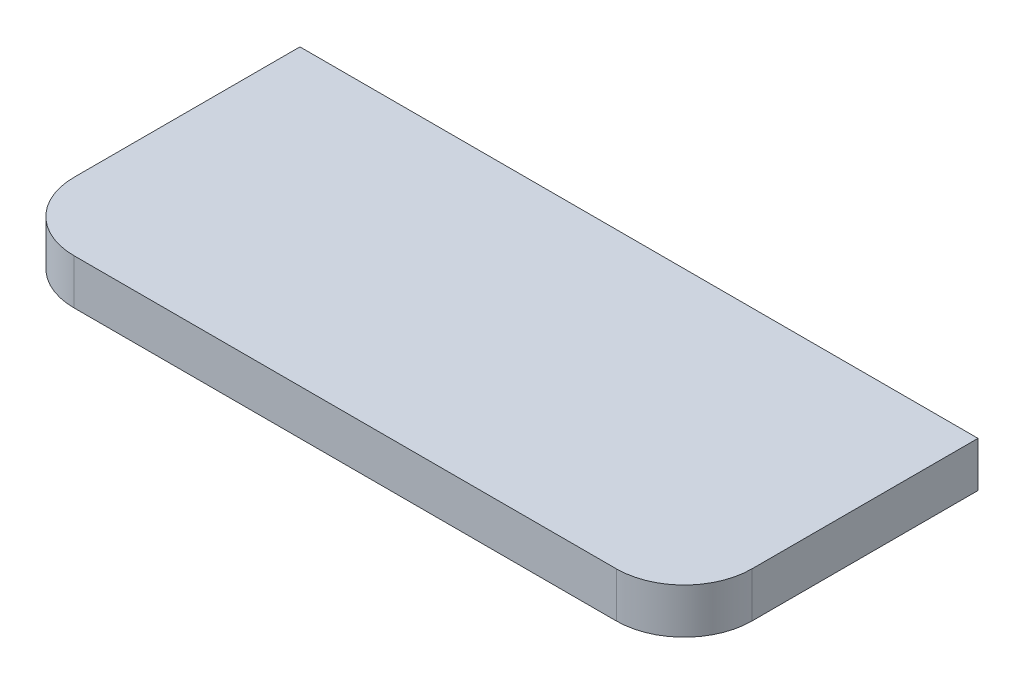
ISO-10303-21;
HEADER;
FILE_DESCRIPTION(('STEP AP214'),'2;1');
FILE_NAME('part.step','',(''),(''),'','','');
FILE_SCHEMA(('AUTOMOTIVE_DESIGN { 1 0 10303 214 1 1 1 1 }'));
ENDSEC;
DATA;
#1=APPLICATION_CONTEXT('core data for automotive mechanical design processes');
#2=APPLICATION_PROTOCOL_DEFINITION('international standard','automotive_design',2000,#1);
#3=PRODUCT_CONTEXT('',#1,'mechanical');
#4=PRODUCT('Part','Part','',(#3));
#5=PRODUCT_RELATED_PRODUCT_CATEGORY('part','',(#4));
#6=PRODUCT_DEFINITION_FORMATION('','',#4);
#7=PRODUCT_DEFINITION_CONTEXT('part definition',#1,'design');
#8=PRODUCT_DEFINITION('design','',#6,#7);
#9=PRODUCT_DEFINITION_SHAPE('','',#8);
#10=(LENGTH_UNIT() NAMED_UNIT(*) SI_UNIT(.MILLI.,.METRE.));
#11=(NAMED_UNIT(*) PLANE_ANGLE_UNIT() SI_UNIT($,.RADIAN.));
#12=(NAMED_UNIT(*) SI_UNIT($,.STERADIAN.) SOLID_ANGLE_UNIT());
#13=UNCERTAINTY_MEASURE_WITH_UNIT(LENGTH_MEASURE(1.E-05),#10,'distance_accuracy_value','');
#14=(GEOMETRIC_REPRESENTATION_CONTEXT(3) GLOBAL_UNCERTAINTY_ASSIGNED_CONTEXT((#13)) GLOBAL_UNIT_ASSIGNED_CONTEXT((#10,
#11,#12)) REPRESENTATION_CONTEXT('',''));
#15=CARTESIAN_POINT('',(0.,0.,0.));
#16=DIRECTION('',(0.,0.,1.));
#17=DIRECTION('',(1.,0.,0.));
#18=AXIS2_PLACEMENT_3D('',#15,#16,#17);
#19=CARTESIAN_POINT('',(-75.,10.,0.));
#20=DIRECTION('',(1.,0.,0.));
#21=DIRECTION('',(0.,0.,-1.));
#22=AXIS2_PLACEMENT_3D('',#19,#20,#21);
#23=PLANE('',#22);
#24=DIRECTION('',(0.,0.,1.));
#25=VECTOR('',#24,1.);
#26=CARTESIAN_POINT('',(-75.,0.,0.));
#27=LINE('',#26,#25);
#28=CARTESIAN_POINT('',(-75.,0.,0.));
#29=VERTEX_POINT('',#28);
#30=CARTESIAN_POINT('',(-75.,0.,50.));
#31=VERTEX_POINT('',#30);
#32=EDGE_CURVE('E128',#29,#31,#27,.T.);
#33=ORIENTED_EDGE('',*,*,#32,.T.);
#34=DIRECTION('',(0.,-1.,0.));
#35=VECTOR('',#34,1.);
#36=CARTESIAN_POINT('',(-75.,10.,50.));
#37=LINE('',#36,#35);
#38=CARTESIAN_POINT('',(-75.,10.,50.));
#39=VERTEX_POINT('',#38);
#40=EDGE_CURVE('E11',#39,#31,#37,.T.);
#41=ORIENTED_EDGE('',*,*,#40,.F.);
#42=DIRECTION('',(0.,0.,1.));
#43=VECTOR('',#42,1.);
#44=CARTESIAN_POINT('',(-75.,10.,0.));
#45=LINE('',#44,#43);
#46=CARTESIAN_POINT('',(-75.,10.,0.));
#47=VERTEX_POINT('',#46);
#48=EDGE_CURVE('E144',#47,#39,#45,.T.);
#49=ORIENTED_EDGE('',*,*,#48,.F.);
#50=DIRECTION('',(0.,-1.,0.));
#51=VECTOR('',#50,1.);
#52=CARTESIAN_POINT('',(-75.,10.,0.));
#53=LINE('',#52,#51);
#54=EDGE_CURVE('E124',#47,#29,#53,.T.);
#55=ORIENTED_EDGE('',*,*,#54,.T.);
#56=EDGE_LOOP('',(#33,#41,#49,#55));
#57=FACE_BOUND('',#56,.T.);
#58=ADVANCED_FACE('F39',(#57),#23,.F.);
#59=CARTESIAN_POINT('',(-60.,10.,50.));
#60=DIRECTION('',(0.,-1.,0.));
#61=DIRECTION('',(0.,0.,-1.));
#62=AXIS2_PLACEMENT_3D('',#59,#60,#61);
#63=CYLINDRICAL_SURFACE('',#62,15.);
#64=CARTESIAN_POINT('',(-60.,0.,50.));
#65=DIRECTION('',(0.,1.,0.));
#66=DIRECTION('',(0.,0.,1.));
#67=AXIS2_PLACEMENT_3D('',#64,#65,#66);
#68=CIRCLE('',#67,15.);
#69=CARTESIAN_POINT('',(-60.,0.,65.));
#70=VERTEX_POINT('',#69);
#71=EDGE_CURVE('E132',#31,#70,#68,.T.);
#72=ORIENTED_EDGE('',*,*,#71,.T.);
#73=DIRECTION('',(0.,-1.,0.));
#74=VECTOR('',#73,1.);
#75=CARTESIAN_POINT('',(-60.,10.,65.));
#76=LINE('',#75,#74);
#77=CARTESIAN_POINT('',(-60.,10.,65.));
#78=VERTEX_POINT('',#77);
#79=EDGE_CURVE('E48',#78,#70,#76,.T.);
#80=ORIENTED_EDGE('',*,*,#79,.F.);
#81=CARTESIAN_POINT('',(-60.,10.,50.));
#82=DIRECTION('',(0.,1.,0.));
#83=DIRECTION('',(0.,0.,1.));
#84=AXIS2_PLACEMENT_3D('',#81,#82,#83);
#85=CIRCLE('',#84,15.);
#86=EDGE_CURVE('E93',#39,#78,#85,.T.);
#87=ORIENTED_EDGE('',*,*,#86,.F.);
#88=ORIENTED_EDGE('',*,*,#40,.T.);
#89=EDGE_LOOP('',(#72,#80,#87,#88));
#90=FACE_BOUND('',#89,.T.);
#91=ADVANCED_FACE('F172',(#90),#63,.T.);
#92=CARTESIAN_POINT('',(-60.,10.,65.));
#93=DIRECTION('',(0.,0.,-1.));
#94=DIRECTION('',(-1.,0.,0.));
#95=AXIS2_PLACEMENT_3D('',#92,#93,#94);
#96=PLANE('',#95);
#97=DIRECTION('',(1.,0.,0.));
#98=VECTOR('',#97,1.);
#99=CARTESIAN_POINT('',(-60.,0.,65.));
#100=LINE('',#99,#98);
#101=CARTESIAN_POINT('',(60.,0.,65.));
#102=VERTEX_POINT('',#101);
#103=EDGE_CURVE('E135',#70,#102,#100,.T.);
#104=ORIENTED_EDGE('',*,*,#103,.T.);
#105=DIRECTION('',(0.,-1.,0.));
#106=VECTOR('',#105,1.);
#107=CARTESIAN_POINT('',(60.,10.,65.));
#108=LINE('',#107,#106);
#109=CARTESIAN_POINT('',(60.,10.,65.));
#110=VERTEX_POINT('',#109);
#111=EDGE_CURVE('E117',#110,#102,#108,.T.);
#112=ORIENTED_EDGE('',*,*,#111,.F.);
#113=DIRECTION('',(1.,0.,0.));
#114=VECTOR('',#113,1.);
#115=CARTESIAN_POINT('',(-60.,10.,65.));
#116=LINE('',#115,#114);
#117=EDGE_CURVE('E106',#78,#110,#116,.T.);
#118=ORIENTED_EDGE('',*,*,#117,.F.);
#119=ORIENTED_EDGE('',*,*,#79,.T.);
#120=EDGE_LOOP('',(#104,#112,#118,#119));
#121=FACE_BOUND('',#120,.T.);
#122=ADVANCED_FACE('F154',(#121),#96,.F.);
#123=CARTESIAN_POINT('',(60.,10.,50.));
#124=DIRECTION('',(0.,-1.,0.));
#125=DIRECTION('',(0.,0.,-1.));
#126=AXIS2_PLACEMENT_3D('',#123,#124,#125);
#127=CYLINDRICAL_SURFACE('',#126,15.);
#128=CARTESIAN_POINT('',(60.,0.,50.));
#129=DIRECTION('',(0.,1.,0.));
#130=DIRECTION('',(0.,0.,1.));
#131=AXIS2_PLACEMENT_3D('',#128,#129,#130);
#132=CIRCLE('',#131,15.);
#133=CARTESIAN_POINT('',(75.,0.,50.));
#134=VERTEX_POINT('',#133);
#135=EDGE_CURVE('E115',#102,#134,#132,.T.);
#136=ORIENTED_EDGE('',*,*,#135,.T.);
#137=DIRECTION('',(0.,-1.,0.));
#138=VECTOR('',#137,1.);
#139=CARTESIAN_POINT('',(75.,10.,50.));
#140=LINE('',#139,#138);
#141=CARTESIAN_POINT('',(75.,10.,50.));
#142=VERTEX_POINT('',#141);
#143=EDGE_CURVE('E112',#142,#134,#140,.T.);
#144=ORIENTED_EDGE('',*,*,#143,.F.);
#145=CARTESIAN_POINT('',(60.,10.,50.));
#146=DIRECTION('',(0.,1.,0.));
#147=DIRECTION('',(0.,0.,1.));
#148=AXIS2_PLACEMENT_3D('',#145,#146,#147);
#149=CIRCLE('',#148,15.);
#150=EDGE_CURVE('E100',#110,#142,#149,.T.);
#151=ORIENTED_EDGE('',*,*,#150,.F.);
#152=ORIENTED_EDGE('',*,*,#111,.T.);
#153=EDGE_LOOP('',(#136,#144,#151,#152));
#154=FACE_BOUND('',#153,.T.);
#155=ADVANCED_FACE('F113',(#154),#127,.T.);
#156=CARTESIAN_POINT('',(75.,10.,0.));
#157=DIRECTION('',(-1.,0.,0.));
#158=DIRECTION('',(0.,0.,1.));
#159=AXIS2_PLACEMENT_3D('',#156,#157,#158);
#160=PLANE('',#159);
#161=DIRECTION('',(0.,0.,-1.));
#162=VECTOR('',#161,1.);
#163=CARTESIAN_POINT('',(75.,0.,0.));
#164=LINE('',#163,#162);
#165=CARTESIAN_POINT('',(75.,0.,0.));
#166=VERTEX_POINT('',#165);
#167=EDGE_CURVE('E79',#134,#166,#164,.T.);
#168=ORIENTED_EDGE('',*,*,#167,.T.);
#169=DIRECTION('',(0.,-1.,0.));
#170=VECTOR('',#169,1.);
#171=CARTESIAN_POINT('',(75.,10.,0.));
#172=LINE('',#171,#170);
#173=CARTESIAN_POINT('',(75.,10.,0.));
#174=VERTEX_POINT('',#173);
#175=EDGE_CURVE('E118',#174,#166,#172,.T.);
#176=ORIENTED_EDGE('',*,*,#175,.F.);
#177=DIRECTION('',(0.,0.,-1.));
#178=VECTOR('',#177,1.);
#179=CARTESIAN_POINT('',(75.,10.,0.));
#180=LINE('',#179,#178);
#181=EDGE_CURVE('E104',#142,#174,#180,.T.);
#182=ORIENTED_EDGE('',*,*,#181,.F.);
#183=ORIENTED_EDGE('',*,*,#143,.T.);
#184=EDGE_LOOP('',(#168,#176,#182,#183));
#185=FACE_BOUND('',#184,.T.);
#186=ADVANCED_FACE('F120',(#185),#160,.F.);
#187=CARTESIAN_POINT('',(-75.,10.,0.));
#188=DIRECTION('',(0.,0.,1.));
#189=DIRECTION('',(1.,0.,0.));
#190=AXIS2_PLACEMENT_3D('',#187,#188,#189);
#191=PLANE('',#190);
#192=DIRECTION('',(-1.,0.,0.));
#193=VECTOR('',#192,1.);
#194=CARTESIAN_POINT('',(-75.,0.,0.));
#195=LINE('',#194,#193);
#196=EDGE_CURVE('E85',#166,#29,#195,.T.);
#197=ORIENTED_EDGE('',*,*,#196,.T.);
#198=ORIENTED_EDGE('',*,*,#54,.F.);
#199=DIRECTION('',(-1.,0.,0.));
#200=VECTOR('',#199,1.);
#201=CARTESIAN_POINT('',(-75.,10.,0.));
#202=LINE('',#201,#200);
#203=EDGE_CURVE('E56',#174,#47,#202,.T.);
#204=ORIENTED_EDGE('',*,*,#203,.F.);
#205=ORIENTED_EDGE('',*,*,#175,.T.);
#206=EDGE_LOOP('',(#197,#198,#204,#205));
#207=FACE_BOUND('',#206,.T.);
#208=ADVANCED_FACE('F161',(#207),#191,.F.);
#209=CARTESIAN_POINT('',(-60.,10.,50.));
#210=DIRECTION('',(0.,1.,0.));
#211=DIRECTION('',(0.,0.,1.));
#212=AXIS2_PLACEMENT_3D('',#209,#210,#211);
#213=PLANE('',#212);
#214=ORIENTED_EDGE('',*,*,#48,.T.);
#215=ORIENTED_EDGE('',*,*,#86,.T.);
#216=ORIENTED_EDGE('',*,*,#117,.T.);
#217=ORIENTED_EDGE('',*,*,#150,.T.);
#218=ORIENTED_EDGE('',*,*,#181,.T.);
#219=ORIENTED_EDGE('',*,*,#203,.T.);
#220=EDGE_LOOP('',(#214,#215,#216,#217,#218,#219));
#221=FACE_BOUND('',#220,.T.);
#222=ADVANCED_FACE('F102',(#221),#213,.T.);
#223=CARTESIAN_POINT('',(-60.,0.,50.));
#224=DIRECTION('',(0.,1.,0.));
#225=DIRECTION('',(0.,0.,1.));
#226=AXIS2_PLACEMENT_3D('',#223,#224,#225);
#227=PLANE('',#226);
#228=ORIENTED_EDGE('',*,*,#32,.F.);
#229=ORIENTED_EDGE('',*,*,#196,.F.);
#230=ORIENTED_EDGE('',*,*,#167,.F.);
#231=ORIENTED_EDGE('',*,*,#135,.F.);
#232=ORIENTED_EDGE('',*,*,#103,.F.);
#233=ORIENTED_EDGE('',*,*,#71,.F.);
#234=EDGE_LOOP('',(#228,#229,#230,#231,#232,#233));
#235=FACE_BOUND('',#234,.T.);
#236=ADVANCED_FACE('F157',(#235),#227,.F.);
#237=CLOSED_SHELL('',(#58,#91,#122,#155,#186,#208,#222,#236));
#238=MANIFOLD_SOLID_BREP('B2',#237);
#239=ADVANCED_BREP_SHAPE_REPRESENTATION('',(#18,#238),#14);
#240=SHAPE_DEFINITION_REPRESENTATION(#9,#239);
ENDSEC;
END-ISO-10303-21;
